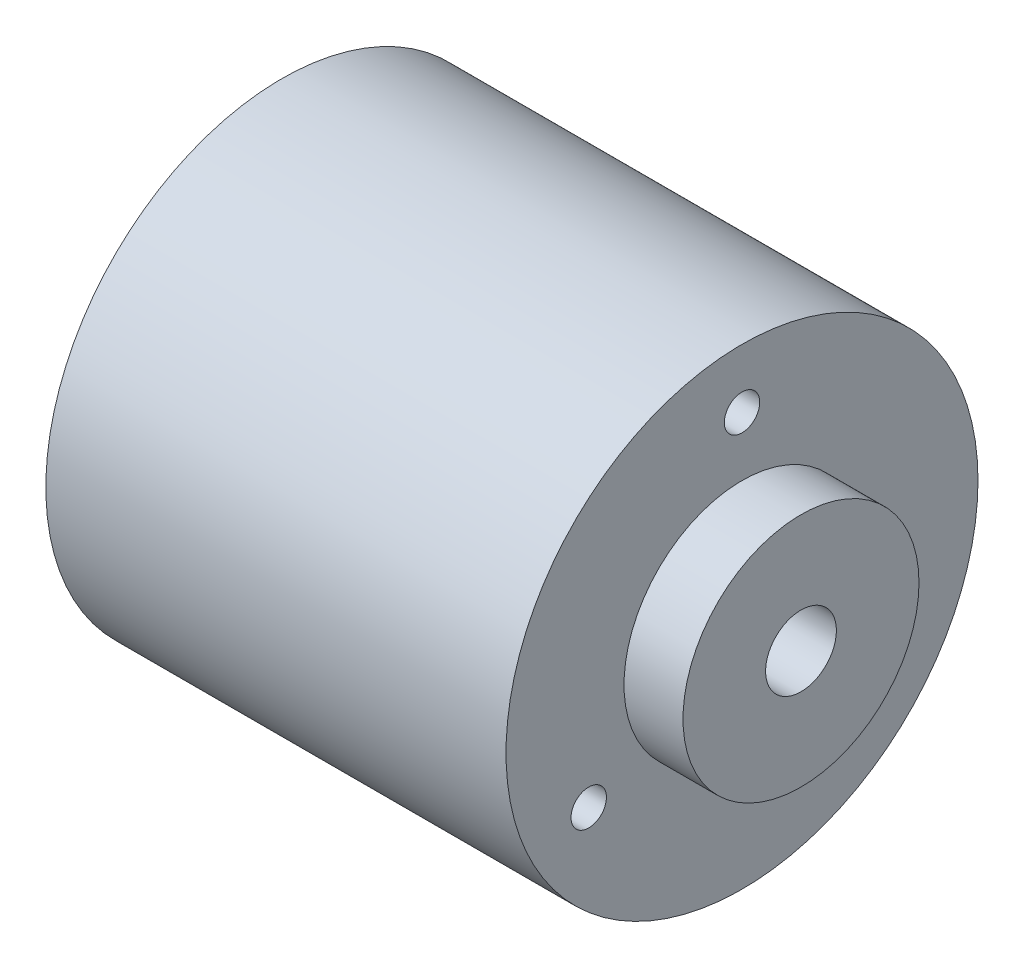
ISO-10303-21;
HEADER;
FILE_DESCRIPTION(('STEP AP214'),'2;1');
FILE_NAME('part.step','',(''),(''),'','','');
FILE_SCHEMA(('AUTOMOTIVE_DESIGN { 1 0 10303 214 1 1 1 1 }'));
ENDSEC;
DATA;
#1=APPLICATION_CONTEXT('core data for automotive mechanical design processes');
#2=APPLICATION_PROTOCOL_DEFINITION('international standard','automotive_design',2000,#1);
#3=PRODUCT_CONTEXT('',#1,'mechanical');
#4=PRODUCT('Part','Part','',(#3));
#5=PRODUCT_RELATED_PRODUCT_CATEGORY('part','',(#4));
#6=PRODUCT_DEFINITION_FORMATION('','',#4);
#7=PRODUCT_DEFINITION_CONTEXT('part definition',#1,'design');
#8=PRODUCT_DEFINITION('design','',#6,#7);
#9=PRODUCT_DEFINITION_SHAPE('','',#8);
#10=(LENGTH_UNIT() NAMED_UNIT(*) SI_UNIT(.MILLI.,.METRE.));
#11=(NAMED_UNIT(*) PLANE_ANGLE_UNIT() SI_UNIT($,.RADIAN.));
#12=(NAMED_UNIT(*) SI_UNIT($,.STERADIAN.) SOLID_ANGLE_UNIT());
#13=UNCERTAINTY_MEASURE_WITH_UNIT(LENGTH_MEASURE(1.E-05),#10,'distance_accuracy_value','');
#14=(GEOMETRIC_REPRESENTATION_CONTEXT(3) GLOBAL_UNCERTAINTY_ASSIGNED_CONTEXT((#13)) GLOBAL_UNIT_ASSIGNED_CONTEXT((#10,
#11,#12)) REPRESENTATION_CONTEXT('',''));
#15=CARTESIAN_POINT('',(0.,0.,0.));
#16=DIRECTION('',(0.,0.,1.));
#17=DIRECTION('',(1.,0.,0.));
#18=AXIS2_PLACEMENT_3D('',#15,#16,#17);
#19=CARTESIAN_POINT('',(39.,0.,0.));
#20=DIRECTION('',(1.,0.,0.));
#21=DIRECTION('',(0.,0.,-1.));
#22=AXIS2_PLACEMENT_3D('',#19,#20,#21);
#23=PLANE('',#22);
#24=CARTESIAN_POINT('',(39.,15.,-1.02146070820057E-12));
#25=DIRECTION('',(1.,0.,0.));
#26=DIRECTION('',(0.,0.,-1.));
#27=AXIS2_PLACEMENT_3D('',#24,#25,#26);
#28=CIRCLE('',#27,1.5);
#29=CARTESIAN_POINT('',(39.,15.,-1.50000000000102));
#30=VERTEX_POINT('',#29);
#31=EDGE_CURVE('E61',#30,#30,#28,.T.);
#32=ORIENTED_EDGE('',*,*,#31,.F.);
#33=EDGE_LOOP('',(#32));
#34=FACE_BOUND('',#33,.T.);
#35=CARTESIAN_POINT('',(39.,-7.50000000000034,-12.990381056767));
#36=DIRECTION('',(1.,0.,0.));
#37=DIRECTION('',(0.,0.,-1.));
#38=AXIS2_PLACEMENT_3D('',#35,#36,#37);
#39=CIRCLE('',#38,1.5);
#40=CARTESIAN_POINT('',(39.,-7.50000000000034,-14.490381056767));
#41=VERTEX_POINT('',#40);
#42=EDGE_CURVE('E60',#41,#41,#39,.T.);
#43=ORIENTED_EDGE('',*,*,#42,.F.);
#44=EDGE_LOOP('',(#43));
#45=FACE_BOUND('',#44,.T.);
#46=CARTESIAN_POINT('',(39.,-7.49999999999966,12.9903810567661));
#47=DIRECTION('',(1.,0.,0.));
#48=DIRECTION('',(0.,0.,-1.));
#49=AXIS2_PLACEMENT_3D('',#46,#47,#48);
#50=CIRCLE('',#49,1.5);
#51=CARTESIAN_POINT('',(39.,-7.49999999999966,11.4903810567661));
#52=VERTEX_POINT('',#51);
#53=EDGE_CURVE('E73',#52,#52,#50,.T.);
#54=ORIENTED_EDGE('',*,*,#53,.F.);
#55=EDGE_LOOP('',(#54));
#56=FACE_BOUND('',#55,.T.);
#57=CARTESIAN_POINT('',(39.,0.,0.));
#58=DIRECTION('',(1.,0.,0.));
#59=DIRECTION('',(0.,0.,-1.));
#60=AXIS2_PLACEMENT_3D('',#57,#58,#59);
#61=CIRCLE('',#60,20.);
#62=CARTESIAN_POINT('',(39.,0.,-20.));
#63=VERTEX_POINT('',#62);
#64=EDGE_CURVE('E11',#63,#63,#61,.T.);
#65=ORIENTED_EDGE('',*,*,#64,.T.);
#66=EDGE_LOOP('',(#65));
#67=FACE_BOUND('',#66,.T.);
#68=CARTESIAN_POINT('',(39.,0.,0.));
#69=DIRECTION('',(1.,0.,0.));
#70=DIRECTION('',(0.,0.,-1.));
#71=AXIS2_PLACEMENT_3D('',#68,#69,#70);
#72=CIRCLE('',#71,10.);
#73=CARTESIAN_POINT('',(39.,0.,-10.));
#74=VERTEX_POINT('',#73);
#75=EDGE_CURVE('E79',#74,#74,#72,.T.);
#76=ORIENTED_EDGE('',*,*,#75,.F.);
#77=EDGE_LOOP('',(#76));
#78=FACE_BOUND('',#77,.T.);
#79=ADVANCED_FACE('F32',(#34,#45,#56,#67,#78),#23,.T.);
#80=CARTESIAN_POINT('',(39.,0.,0.));
#81=DIRECTION('',(-1.,0.,0.));
#82=DIRECTION('',(0.,0.,1.));
#83=AXIS2_PLACEMENT_3D('',#80,#81,#82);
#84=CYLINDRICAL_SURFACE('',#83,20.);
#85=ORIENTED_EDGE('',*,*,#64,.F.);
#86=EDGE_LOOP('',(#85));
#87=FACE_BOUND('',#86,.T.);
#88=CARTESIAN_POINT('',(0.,0.,0.));
#89=DIRECTION('',(1.,0.,0.));
#90=DIRECTION('',(0.,0.,-1.));
#91=AXIS2_PLACEMENT_3D('',#88,#89,#90);
#92=CIRCLE('',#91,20.);
#93=CARTESIAN_POINT('',(0.,0.,-20.));
#94=VERTEX_POINT('',#93);
#95=EDGE_CURVE('E36',#94,#94,#92,.T.);
#96=ORIENTED_EDGE('',*,*,#95,.T.);
#97=EDGE_LOOP('',(#96));
#98=FACE_BOUND('',#97,.T.);
#99=ADVANCED_FACE('F34',(#87,#98),#84,.T.);
#100=CARTESIAN_POINT('',(0.,0.,0.));
#101=DIRECTION('',(1.,0.,0.));
#102=DIRECTION('',(0.,0.,-1.));
#103=AXIS2_PLACEMENT_3D('',#100,#101,#102);
#104=PLANE('',#103);
#105=ORIENTED_EDGE('',*,*,#95,.F.);
#106=EDGE_LOOP('',(#105));
#107=FACE_BOUND('',#106,.T.);
#108=ADVANCED_FACE('F94',(#107),#104,.F.);
#109=CARTESIAN_POINT('',(44.,0.,0.));
#110=DIRECTION('',(-1.,0.,0.));
#111=DIRECTION('',(0.,0.,1.));
#112=AXIS2_PLACEMENT_3D('',#109,#110,#111);
#113=CYLINDRICAL_SURFACE('',#112,10.);
#114=CARTESIAN_POINT('',(44.,0.,0.));
#115=DIRECTION('',(1.,0.,0.));
#116=DIRECTION('',(0.,0.,-1.));
#117=AXIS2_PLACEMENT_3D('',#114,#115,#116);
#118=CIRCLE('',#117,10.);
#119=CARTESIAN_POINT('',(44.,0.,-10.));
#120=VERTEX_POINT('',#119);
#121=EDGE_CURVE('E80',#120,#120,#118,.T.);
#122=ORIENTED_EDGE('',*,*,#121,.F.);
#123=EDGE_LOOP('',(#122));
#124=FACE_BOUND('',#123,.T.);
#125=ORIENTED_EDGE('',*,*,#75,.T.);
#126=EDGE_LOOP('',(#125));
#127=FACE_BOUND('',#126,.T.);
#128=ADVANCED_FACE('F86',(#124,#127),#113,.T.);
#129=CARTESIAN_POINT('',(44.,0.,0.));
#130=DIRECTION('',(1.,0.,0.));
#131=DIRECTION('',(0.,0.,-1.));
#132=AXIS2_PLACEMENT_3D('',#129,#130,#131);
#133=PLANE('',#132);
#134=CARTESIAN_POINT('',(44.,0.,0.));
#135=DIRECTION('',(1.,0.,0.));
#136=DIRECTION('',(0.,0.,-1.));
#137=AXIS2_PLACEMENT_3D('',#134,#135,#136);
#138=CIRCLE('',#137,3.);
#139=CARTESIAN_POINT('',(44.,0.,-3.));
#140=VERTEX_POINT('',#139);
#141=EDGE_CURVE('E146',#140,#140,#138,.T.);
#142=ORIENTED_EDGE('',*,*,#141,.F.);
#143=EDGE_LOOP('',(#142));
#144=FACE_BOUND('',#143,.T.);
#145=ORIENTED_EDGE('',*,*,#121,.T.);
#146=EDGE_LOOP('',(#145));
#147=FACE_BOUND('',#146,.T.);
#148=ADVANCED_FACE('F105',(#144,#147),#133,.T.);
#149=CARTESIAN_POINT('',(32.,-7.49999999999966,12.9903810567661));
#150=DIRECTION('',(1.,0.,0.));
#151=DIRECTION('',(0.,0.,-1.));
#152=AXIS2_PLACEMENT_3D('',#149,#150,#151);
#153=CONICAL_SURFACE('',#152,1.5,1.02974425867665);
#154=CARTESIAN_POINT('',(31.0987090714587,-7.49999999999966,12.9903810567661));
#155=VERTEX_POINT('',#154);
#156=VERTEX_LOOP('',#155);
#157=FACE_BOUND('',#156,.T.);
#158=CARTESIAN_POINT('',(32.,-7.49999999999966,12.9903810567661));
#159=DIRECTION('',(1.,0.,0.));
#160=DIRECTION('',(0.,0.,-1.));
#161=AXIS2_PLACEMENT_3D('',#158,#159,#160);
#162=CIRCLE('',#161,1.5);
#163=CARTESIAN_POINT('',(32.,-7.49999999999966,11.4903810567661));
#164=VERTEX_POINT('',#163);
#165=EDGE_CURVE('E76',#164,#164,#162,.T.);
#166=ORIENTED_EDGE('',*,*,#165,.T.);
#167=EDGE_LOOP('',(#166));
#168=FACE_BOUND('',#167,.T.);
#169=ADVANCED_FACE('F113',(#157,#168),#153,.F.);
#170=CARTESIAN_POINT('',(39.,-7.49999999999966,12.9903810567661));
#171=DIRECTION('',(1.,0.,0.));
#172=DIRECTION('',(0.,0.,-1.));
#173=AXIS2_PLACEMENT_3D('',#170,#171,#172);
#174=CYLINDRICAL_SURFACE('',#173,1.5);
#175=ORIENTED_EDGE('',*,*,#165,.F.);
#176=EDGE_LOOP('',(#175));
#177=FACE_BOUND('',#176,.T.);
#178=ORIENTED_EDGE('',*,*,#53,.T.);
#179=EDGE_LOOP('',(#178));
#180=FACE_BOUND('',#179,.T.);
#181=ADVANCED_FACE('F120',(#177,#180),#174,.F.);
#182=CARTESIAN_POINT('',(32.,-7.50000000000034,-12.990381056767));
#183=DIRECTION('',(1.,0.,0.));
#184=DIRECTION('',(0.,0.,-1.));
#185=AXIS2_PLACEMENT_3D('',#182,#183,#184);
#186=CONICAL_SURFACE('',#185,1.5,1.02974425867665);
#187=CARTESIAN_POINT('',(31.0987090714587,-7.50000000000034,-12.990381056767));
#188=VERTEX_POINT('',#187);
#189=VERTEX_LOOP('',#188);
#190=FACE_BOUND('',#189,.T.);
#191=CARTESIAN_POINT('',(32.,-7.50000000000034,-12.990381056767));
#192=DIRECTION('',(1.,0.,0.));
#193=DIRECTION('',(0.,0.,-1.));
#194=AXIS2_PLACEMENT_3D('',#191,#192,#193);
#195=CIRCLE('',#194,1.5);
#196=CARTESIAN_POINT('',(32.,-7.50000000000034,-14.490381056767));
#197=VERTEX_POINT('',#196);
#198=EDGE_CURVE('E64',#197,#197,#195,.T.);
#199=ORIENTED_EDGE('',*,*,#198,.T.);
#200=EDGE_LOOP('',(#199));
#201=FACE_BOUND('',#200,.T.);
#202=ADVANCED_FACE('F126',(#190,#201),#186,.F.);
#203=CARTESIAN_POINT('',(39.,-7.50000000000034,-12.990381056767));
#204=DIRECTION('',(1.,0.,0.));
#205=DIRECTION('',(0.,0.,-1.));
#206=AXIS2_PLACEMENT_3D('',#203,#204,#205);
#207=CYLINDRICAL_SURFACE('',#206,1.5);
#208=ORIENTED_EDGE('',*,*,#198,.F.);
#209=EDGE_LOOP('',(#208));
#210=FACE_BOUND('',#209,.T.);
#211=ORIENTED_EDGE('',*,*,#42,.T.);
#212=EDGE_LOOP('',(#211));
#213=FACE_BOUND('',#212,.T.);
#214=ADVANCED_FACE('F54',(#210,#213),#207,.F.);
#215=CARTESIAN_POINT('',(32.,15.,-1.02146070820057E-12));
#216=DIRECTION('',(1.,0.,0.));
#217=DIRECTION('',(0.,0.,-1.));
#218=AXIS2_PLACEMENT_3D('',#215,#216,#217);
#219=CONICAL_SURFACE('',#218,1.5,1.02974425867665);
#220=CARTESIAN_POINT('',(31.0987090714587,15.,-1.02146070820057E-12));
#221=VERTEX_POINT('',#220);
#222=VERTEX_LOOP('',#221);
#223=FACE_BOUND('',#222,.T.);
#224=CARTESIAN_POINT('',(32.,15.,-1.02146070820057E-12));
#225=DIRECTION('',(1.,0.,0.));
#226=DIRECTION('',(0.,0.,-1.));
#227=AXIS2_PLACEMENT_3D('',#224,#225,#226);
#228=CIRCLE('',#227,1.5);
#229=CARTESIAN_POINT('',(32.,15.,-1.50000000000102));
#230=VERTEX_POINT('',#229);
#231=EDGE_CURVE('E58',#230,#230,#228,.T.);
#232=ORIENTED_EDGE('',*,*,#231,.T.);
#233=EDGE_LOOP('',(#232));
#234=FACE_BOUND('',#233,.T.);
#235=ADVANCED_FACE('F50',(#223,#234),#219,.F.);
#236=CARTESIAN_POINT('',(39.,15.,-1.02146070820057E-12));
#237=DIRECTION('',(1.,0.,0.));
#238=DIRECTION('',(0.,0.,-1.));
#239=AXIS2_PLACEMENT_3D('',#236,#237,#238);
#240=CYLINDRICAL_SURFACE('',#239,1.5);
#241=ORIENTED_EDGE('',*,*,#231,.F.);
#242=EDGE_LOOP('',(#241));
#243=FACE_BOUND('',#242,.T.);
#244=ORIENTED_EDGE('',*,*,#31,.T.);
#245=EDGE_LOOP('',(#244));
#246=FACE_BOUND('',#245,.T.);
#247=ADVANCED_FACE('F53',(#243,#246),#240,.F.);
#248=CARTESIAN_POINT('',(39.,0.,0.));
#249=DIRECTION('',(1.,0.,0.));
#250=DIRECTION('',(0.,0.,-1.));
#251=AXIS2_PLACEMENT_3D('',#248,#249,#250);
#252=CYLINDRICAL_SURFACE('',#251,3.);
#253=CARTESIAN_POINT('',(39.,0.,0.));
#254=DIRECTION('',(1.,0.,0.));
#255=DIRECTION('',(0.,0.,-1.));
#256=AXIS2_PLACEMENT_3D('',#253,#254,#255);
#257=CIRCLE('',#256,3.);
#258=CARTESIAN_POINT('',(39.,0.,-3.));
#259=VERTEX_POINT('',#258);
#260=EDGE_CURVE('E67',#259,#259,#257,.T.);
#261=ORIENTED_EDGE('',*,*,#260,.F.);
#262=EDGE_LOOP('',(#261));
#263=FACE_BOUND('',#262,.T.);
#264=ORIENTED_EDGE('',*,*,#141,.T.);
#265=EDGE_LOOP('',(#264));
#266=FACE_BOUND('',#265,.T.);
#267=ADVANCED_FACE('F135',(#263,#266),#252,.F.);
#268=CARTESIAN_POINT('',(39.,0.,0.));
#269=DIRECTION('',(1.,0.,0.));
#270=DIRECTION('',(0.,0.,-1.));
#271=AXIS2_PLACEMENT_3D('',#268,#269,#270);
#272=PLANE('',#271);
#273=ORIENTED_EDGE('',*,*,#260,.T.);
#274=EDGE_LOOP('',(#273));
#275=FACE_BOUND('',#274,.T.);
#276=ADVANCED_FACE('F138',(#275),#272,.T.);
#277=CLOSED_SHELL('',(#79,#99,#108,#128,#148,#169,#181,#202,#214,#235,#247,#267,#276));
#278=MANIFOLD_SOLID_BREP('B2',#277);
#279=ADVANCED_BREP_SHAPE_REPRESENTATION('',(#18,#278),#14);
#280=SHAPE_DEFINITION_REPRESENTATION(#9,#279);
ENDSEC;
END-ISO-10303-21;
